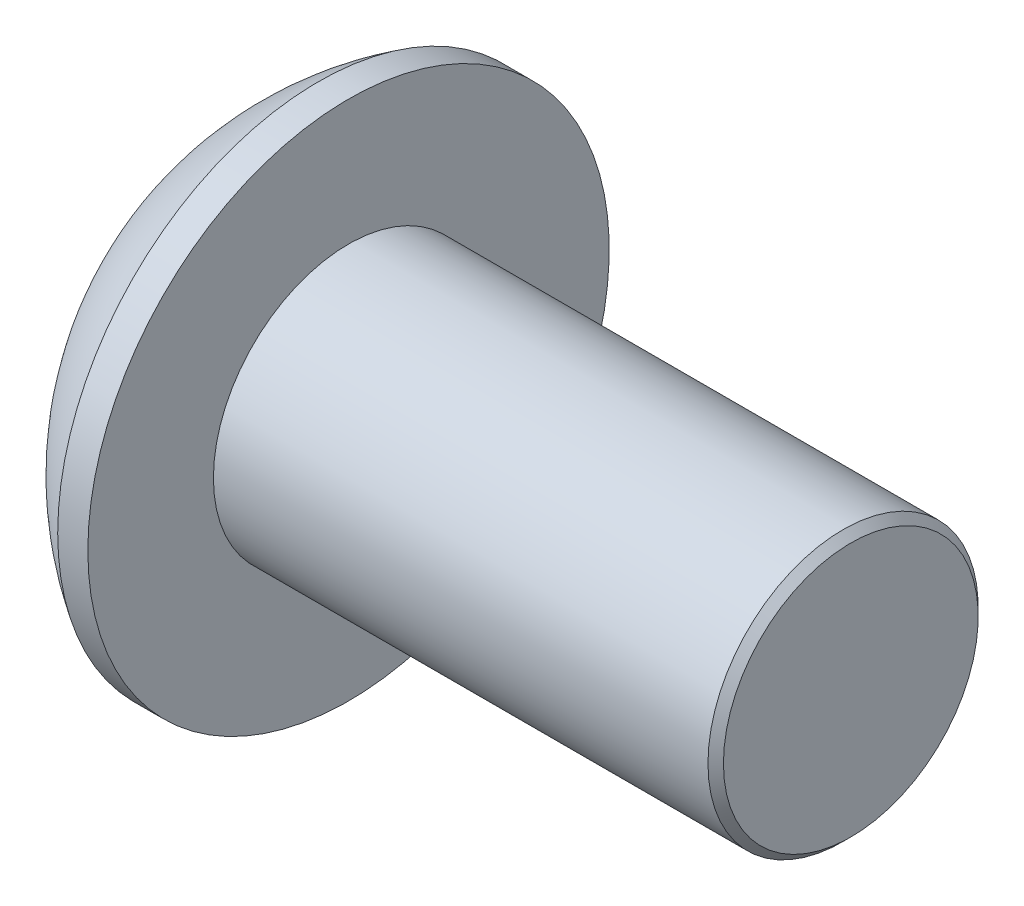
ISO-10303-21;
HEADER;
FILE_DESCRIPTION(('STEP AP214'),'2;1');
FILE_NAME('part.step','',(''),(''),'','','');
FILE_SCHEMA(('AUTOMOTIVE_DESIGN { 1 0 10303 214 1 1 1 1 }'));
ENDSEC;
DATA;
#1=APPLICATION_CONTEXT('core data for automotive mechanical design processes');
#2=APPLICATION_PROTOCOL_DEFINITION('international standard','automotive_design',2000,#1);
#3=PRODUCT_CONTEXT('',#1,'mechanical');
#4=PRODUCT('Part','Part','',(#3));
#5=PRODUCT_RELATED_PRODUCT_CATEGORY('part','',(#4));
#6=PRODUCT_DEFINITION_FORMATION('','',#4);
#7=PRODUCT_DEFINITION_CONTEXT('part definition',#1,'design');
#8=PRODUCT_DEFINITION('design','',#6,#7);
#9=PRODUCT_DEFINITION_SHAPE('','',#8);
#10=(LENGTH_UNIT() NAMED_UNIT(*) SI_UNIT(.MILLI.,.METRE.));
#11=(NAMED_UNIT(*) PLANE_ANGLE_UNIT() SI_UNIT($,.RADIAN.));
#12=(NAMED_UNIT(*) SI_UNIT($,.STERADIAN.) SOLID_ANGLE_UNIT());
#13=UNCERTAINTY_MEASURE_WITH_UNIT(LENGTH_MEASURE(1.E-05),#10,'distance_accuracy_value','');
#14=(GEOMETRIC_REPRESENTATION_CONTEXT(3) GLOBAL_UNCERTAINTY_ASSIGNED_CONTEXT((#13)) GLOBAL_UNIT_ASSIGNED_CONTEXT((#10,
#11,#12)) REPRESENTATION_CONTEXT('',''));
#15=CARTESIAN_POINT('',(0.,0.,0.));
#16=DIRECTION('',(0.,0.,1.));
#17=DIRECTION('',(1.,0.,0.));
#18=AXIS2_PLACEMENT_3D('',#15,#16,#17);
#19=CARTESIAN_POINT('',(8.20419999999999,0.,0.));
#20=DIRECTION('',(-1.,0.,0.));
#21=DIRECTION('',(0.,0.,1.));
#22=AXIS2_PLACEMENT_3D('',#19,#20,#21);
#23=PLANE('',#22);
#24=CARTESIAN_POINT('',(8.20419999996602,0.,0.));
#25=DIRECTION('',(-1.,0.,0.));
#26=DIRECTION('',(0.,0.,1.));
#27=AXIS2_PLACEMENT_3D('',#24,#25,#26);
#28=CIRCLE('',#27,1.61036000014295);
#29=CARTESIAN_POINT('',(8.20419999996602,0.,1.61036000014292));
#30=VERTEX_POINT('',#29);
#31=EDGE_CURVE('E21',#30,#30,#28,.T.);
#32=ORIENTED_EDGE('',*,*,#31,.F.);
#33=EDGE_LOOP('',(#32));
#34=FACE_BOUND('',#33,.T.);
#35=ADVANCED_FACE('F17',(#34),#23,.F.);
#36=CARTESIAN_POINT('',(8.10641000009582,0.,0.));
#37=DIRECTION('',(-1.,0.,0.));
#38=DIRECTION('',(0.,0.,1.));
#39=AXIS2_PLACEMENT_3D('',#36,#37,#38);
#40=CONICAL_SURFACE('',#39,1.7081499999563,0.785398163106808);
#41=ORIENTED_EDGE('',*,*,#31,.T.);
#42=EDGE_LOOP('',(#41));
#43=FACE_BOUND('',#42,.T.);
#44=CARTESIAN_POINT('',(8.10641000000001,0.,0.));
#45=DIRECTION('',(-1.,0.,0.));
#46=DIRECTION('',(0.,0.,1.));
#47=AXIS2_PLACEMENT_3D('',#44,#45,#46);
#48=CIRCLE('',#47,1.70815);
#49=CARTESIAN_POINT('',(8.10641000000001,0.,1.70815));
#50=VERTEX_POINT('',#49);
#51=EDGE_CURVE('E109',#50,#50,#48,.T.);
#52=ORIENTED_EDGE('',*,*,#51,.F.);
#53=EDGE_LOOP('',(#52));
#54=FACE_BOUND('',#53,.T.);
#55=ADVANCED_FACE('F311',(#43,#54),#40,.T.);
#56=CARTESIAN_POINT('',(1.32079999997359,0.,0.));
#57=DIRECTION('',(-1.,0.,0.));
#58=DIRECTION('',(0.,0.,1.));
#59=AXIS2_PLACEMENT_3D('',#56,#57,#58);
#60=CONICAL_SURFACE('',#59,1.19380000001001,1.04719755119008);
#61=CARTESIAN_POINT('',(2.0100407513155,0.,0.));
#62=VERTEX_POINT('',#61);
#63=VERTEX_LOOP('',#62);
#64=FACE_BOUND('',#63,.T.);
#65=CARTESIAN_POINT('',(1.32079999997359,0.,0.));
#66=DIRECTION('',(-1.,0.,0.));
#67=DIRECTION('',(0.,0.,1.));
#68=AXIS2_PLACEMENT_3D('',#65,#66,#67);
#69=CIRCLE('',#68,1.19380000001001);
#70=CARTESIAN_POINT('',(1.32079999998681,-1.0338611270422,0.596900000002504));
#71=VERTEX_POINT('',#70);
#72=CARTESIAN_POINT('',(1.32079999998681,0.,1.19380000000501));
#73=VERTEX_POINT('',#72);
#74=EDGE_CURVE('E94',#71,#73,#69,.T.);
#75=ORIENTED_EDGE('',*,*,#74,.T.);
#76=CARTESIAN_POINT('',(1.32079999997359,0.,0.));
#77=DIRECTION('',(-1.,0.,0.));
#78=DIRECTION('',(0.,0.,1.));
#79=AXIS2_PLACEMENT_3D('',#76,#77,#78);
#80=CIRCLE('',#79,1.19380000001001);
#81=CARTESIAN_POINT('',(1.32079999998681,1.0338611270422,0.596900000002503));
#82=VERTEX_POINT('',#81);
#83=EDGE_CURVE('E88',#73,#82,#80,.T.);
#84=ORIENTED_EDGE('',*,*,#83,.T.);
#85=CARTESIAN_POINT('',(1.32079999997359,0.,0.));
#86=DIRECTION('',(-1.,0.,0.));
#87=DIRECTION('',(0.,0.,1.));
#88=AXIS2_PLACEMENT_3D('',#85,#86,#87);
#89=CIRCLE('',#88,1.19380000001001);
#90=CARTESIAN_POINT('',(1.32079999998681,1.0338611270422,-0.596900000002504));
#91=VERTEX_POINT('',#90);
#92=EDGE_CURVE('E91',#82,#91,#89,.T.);
#93=ORIENTED_EDGE('',*,*,#92,.T.);
#94=CARTESIAN_POINT('',(1.32079999997359,0.,0.));
#95=DIRECTION('',(-1.,0.,0.));
#96=DIRECTION('',(0.,0.,1.));
#97=AXIS2_PLACEMENT_3D('',#94,#95,#96);
#98=CIRCLE('',#97,1.19380000001001);
#99=CARTESIAN_POINT('',(1.32079999998681,1.49525563250748E-12,-1.19380000000501));
#100=VERTEX_POINT('',#99);
#101=EDGE_CURVE('E153',#91,#100,#98,.T.);
#102=ORIENTED_EDGE('',*,*,#101,.T.);
#103=CARTESIAN_POINT('',(1.32079999997359,0.,0.));
#104=DIRECTION('',(-1.,0.,0.));
#105=DIRECTION('',(0.,0.,1.));
#106=AXIS2_PLACEMENT_3D('',#103,#104,#105);
#107=CIRCLE('',#106,1.19380000001001);
#108=CARTESIAN_POINT('',(1.32079999998681,-1.0338611270422,-0.596900000002502));
#109=VERTEX_POINT('',#108);
#110=EDGE_CURVE('E155',#100,#109,#107,.T.);
#111=ORIENTED_EDGE('',*,*,#110,.T.);
#112=CARTESIAN_POINT('',(1.32079999997359,0.,0.));
#113=DIRECTION('',(-1.,0.,0.));
#114=DIRECTION('',(0.,0.,1.));
#115=AXIS2_PLACEMENT_3D('',#112,#113,#114);
#116=CIRCLE('',#115,1.19380000001001);
#117=EDGE_CURVE('E157',#109,#71,#116,.T.);
#118=ORIENTED_EDGE('',*,*,#117,.T.);
#119=EDGE_LOOP('',(#75,#84,#93,#102,#111,#118));
#120=FACE_BOUND('',#119,.T.);
#121=ADVANCED_FACE('F90',(#64,#120),#60,.F.);
#122=CARTESIAN_POINT('',(0.,0.,0.));
#123=DIRECTION('',(-1.,0.,0.));
#124=DIRECTION('',(0.,0.,1.));
#125=AXIS2_PLACEMENT_3D('',#122,#123,#124);
#126=CYLINDRICAL_SURFACE('',#125,1.70815);
#127=ORIENTED_EDGE('',*,*,#51,.T.);
#128=EDGE_LOOP('',(#127));
#129=FACE_BOUND('',#128,.T.);
#130=CARTESIAN_POINT('',(1.8542,0.,0.));
#131=DIRECTION('',(-1.,0.,0.));
#132=DIRECTION('',(0.,0.,1.));
#133=AXIS2_PLACEMENT_3D('',#130,#131,#132);
#134=CIRCLE('',#133,1.70815);
#135=CARTESIAN_POINT('',(1.8542,0.,1.70815));
#136=VERTEX_POINT('',#135);
#137=EDGE_CURVE('E150',#136,#136,#134,.F.);
#138=ORIENTED_EDGE('',*,*,#137,.T.);
#139=EDGE_LOOP('',(#138));
#140=FACE_BOUND('',#139,.T.);
#141=ADVANCED_FACE('F302',(#129,#140),#126,.T.);
#142=CARTESIAN_POINT('',(1.3208,-2.06772225407573,-1.1938));
#143=DIRECTION('',(1.,0.,0.));
#144=DIRECTION('',(0.,0.,-1.));
#145=AXIS2_PLACEMENT_3D('',#142,#143,#144);
#146=PLANE('',#145);
#147=DIRECTION('',(0.,-0.5,-0.866025403784439));
#148=VECTOR('',#147,1.);
#149=CARTESIAN_POINT('',(1.32080000000004,1.37848150271715,0.));
#150=LINE('',#149,#148);
#151=CARTESIAN_POINT('',(1.32080000000001,1.37848150271715,0.));
#152=VERTEX_POINT('',#151);
#153=EDGE_CURVE('E107',#91,#152,#150,.F.);
#154=ORIENTED_EDGE('',*,*,#153,.F.);
#155=ORIENTED_EDGE('',*,*,#92,.F.);
#156=DIRECTION('',(0.,0.5,-0.866025403784439));
#157=VECTOR('',#156,1.);
#158=CARTESIAN_POINT('',(1.3208,0.689240751358573,1.1938));
#159=LINE('',#158,#157);
#160=EDGE_CURVE('E105',#152,#82,#159,.F.);
#161=ORIENTED_EDGE('',*,*,#160,.F.);
#162=EDGE_LOOP('',(#154,#155,#161));
#163=FACE_BOUND('',#162,.T.);
#164=ADVANCED_FACE('F103',(#163),#146,.F.);
#165=CARTESIAN_POINT('',(1.3208,-2.06772225407573,-1.1938));
#166=DIRECTION('',(1.,0.,0.));
#167=DIRECTION('',(0.,0.,-1.));
#168=AXIS2_PLACEMENT_3D('',#165,#166,#167);
#169=PLANE('',#168);
#170=DIRECTION('',(0.,0.5,-0.866025403784439));
#171=VECTOR('',#170,1.);
#172=CARTESIAN_POINT('',(1.32080000000004,0.689240751358573,1.1938));
#173=LINE('',#172,#171);
#174=CARTESIAN_POINT('',(1.32080000000001,0.689240751358576,1.1938));
#175=VERTEX_POINT('',#174);
#176=EDGE_CURVE('E110',#82,#175,#173,.F.);
#177=ORIENTED_EDGE('',*,*,#176,.F.);
#178=ORIENTED_EDGE('',*,*,#83,.F.);
#179=DIRECTION('',(0.,1.,0.));
#180=VECTOR('',#179,1.);
#181=CARTESIAN_POINT('',(1.3208,-0.689240751358573,1.1938));
#182=LINE('',#181,#180);
#183=EDGE_CURVE('E113',#175,#73,#182,.F.);
#184=ORIENTED_EDGE('',*,*,#183,.F.);
#185=EDGE_LOOP('',(#177,#178,#184));
#186=FACE_BOUND('',#185,.T.);
#187=ADVANCED_FACE('F111',(#186),#169,.F.);
#188=CARTESIAN_POINT('',(1.3208,-2.06772225407573,-1.1938));
#189=DIRECTION('',(1.,0.,0.));
#190=DIRECTION('',(0.,0.,-1.));
#191=AXIS2_PLACEMENT_3D('',#188,#189,#190);
#192=PLANE('',#191);
#193=DIRECTION('',(0.,1.,0.));
#194=VECTOR('',#193,1.);
#195=CARTESIAN_POINT('',(1.32080000000004,-0.689240751358573,1.1938));
#196=LINE('',#195,#194);
#197=CARTESIAN_POINT('',(1.32080000000001,-0.689240751358577,1.1938));
#198=VERTEX_POINT('',#197);
#199=EDGE_CURVE('E171',#73,#198,#196,.F.);
#200=ORIENTED_EDGE('',*,*,#199,.F.);
#201=ORIENTED_EDGE('',*,*,#74,.F.);
#202=DIRECTION('',(0.,0.5,0.866025403784439));
#203=VECTOR('',#202,1.);
#204=CARTESIAN_POINT('',(1.3208,-1.37848150271715,0.));
#205=LINE('',#204,#203);
#206=EDGE_CURVE('E169',#198,#71,#205,.F.);
#207=ORIENTED_EDGE('',*,*,#206,.F.);
#208=EDGE_LOOP('',(#200,#201,#207));
#209=FACE_BOUND('',#208,.T.);
#210=ADVANCED_FACE('F167',(#209),#192,.F.);
#211=CARTESIAN_POINT('',(1.3208,-2.06772225407573,-1.1938));
#212=DIRECTION('',(1.,0.,0.));
#213=DIRECTION('',(0.,0.,-1.));
#214=AXIS2_PLACEMENT_3D('',#211,#212,#213);
#215=PLANE('',#214);
#216=DIRECTION('',(0.,0.5,0.866025403784439));
#217=VECTOR('',#216,1.);
#218=CARTESIAN_POINT('',(1.32080000000004,-1.37848150271715,0.));
#219=LINE('',#218,#217);
#220=CARTESIAN_POINT('',(1.32080000000001,-1.37848150271715,0.));
#221=VERTEX_POINT('',#220);
#222=EDGE_CURVE('E172',#71,#221,#219,.F.);
#223=ORIENTED_EDGE('',*,*,#222,.F.);
#224=ORIENTED_EDGE('',*,*,#117,.F.);
#225=DIRECTION('',(0.,-0.5,0.866025403784439));
#226=VECTOR('',#225,1.);
#227=CARTESIAN_POINT('',(1.3208,-0.689240751358573,-1.1938));
#228=LINE('',#227,#226);
#229=EDGE_CURVE('E175',#221,#109,#228,.F.);
#230=ORIENTED_EDGE('',*,*,#229,.F.);
#231=EDGE_LOOP('',(#223,#224,#230));
#232=FACE_BOUND('',#231,.T.);
#233=ADVANCED_FACE('F173',(#232),#215,.F.);
#234=CARTESIAN_POINT('',(1.3208,-2.06772225407573,-1.1938));
#235=DIRECTION('',(1.,0.,0.));
#236=DIRECTION('',(0.,0.,-1.));
#237=AXIS2_PLACEMENT_3D('',#234,#235,#236);
#238=PLANE('',#237);
#239=DIRECTION('',(0.,-0.5,0.866025403784439));
#240=VECTOR('',#239,1.);
#241=CARTESIAN_POINT('',(1.32080000000004,-0.689240751358573,-1.1938));
#242=LINE('',#241,#240);
#243=CARTESIAN_POINT('',(1.32080000000001,-0.689240751358573,-1.1938));
#244=VERTEX_POINT('',#243);
#245=EDGE_CURVE('E230',#109,#244,#242,.F.);
#246=ORIENTED_EDGE('',*,*,#245,.F.);
#247=ORIENTED_EDGE('',*,*,#110,.F.);
#248=DIRECTION('',(0.,-1.,0.));
#249=VECTOR('',#248,1.);
#250=CARTESIAN_POINT('',(1.3208,0.689240751358573,-1.1938));
#251=LINE('',#250,#249);
#252=EDGE_CURVE('E242',#244,#100,#251,.F.);
#253=ORIENTED_EDGE('',*,*,#252,.F.);
#254=EDGE_LOOP('',(#246,#247,#253));
#255=FACE_BOUND('',#254,.T.);
#256=ADVANCED_FACE('F263',(#255),#238,.F.);
#257=CARTESIAN_POINT('',(1.3208,-2.06772225407573,-1.1938));
#258=DIRECTION('',(1.,0.,0.));
#259=DIRECTION('',(0.,0.,-1.));
#260=AXIS2_PLACEMENT_3D('',#257,#258,#259);
#261=PLANE('',#260);
#262=DIRECTION('',(0.,-1.,0.));
#263=VECTOR('',#262,1.);
#264=CARTESIAN_POINT('',(1.32080000000004,0.689240751358573,-1.1938));
#265=LINE('',#264,#263);
#266=CARTESIAN_POINT('',(1.32080000000002,0.689240751358564,-1.19380000000002));
#267=VERTEX_POINT('',#266);
#268=EDGE_CURVE('E250',#100,#267,#265,.F.);
#269=ORIENTED_EDGE('',*,*,#268,.F.);
#270=ORIENTED_EDGE('',*,*,#101,.F.);
#271=DIRECTION('',(0.,-0.5,-0.866025403784439));
#272=VECTOR('',#271,1.);
#273=CARTESIAN_POINT('',(1.3208,1.37848150271715,0.));
#274=LINE('',#273,#272);
#275=EDGE_CURVE('E132',#267,#91,#274,.F.);
#276=ORIENTED_EDGE('',*,*,#275,.F.);
#277=EDGE_LOOP('',(#269,#270,#276));
#278=FACE_BOUND('',#277,.T.);
#279=ADVANCED_FACE('F265',(#278),#261,.F.);
#280=CARTESIAN_POINT('',(1.8542,1.70815,0.));
#281=DIRECTION('',(-1.,0.,0.));
#282=DIRECTION('',(0.,0.,1.));
#283=AXIS2_PLACEMENT_3D('',#280,#281,#282);
#284=PLANE('',#283);
#285=CARTESIAN_POINT('',(1.8542,0.,0.));
#286=DIRECTION('',(-1.,0.,0.));
#287=DIRECTION('',(0.,0.,1.));
#288=AXIS2_PLACEMENT_3D('',#285,#286,#287);
#289=CIRCLE('',#288,3.29565);
#290=CARTESIAN_POINT('',(1.8542,0.,3.29565));
#291=VERTEX_POINT('',#290);
#292=EDGE_CURVE('E139',#291,#291,#289,.T.);
#293=ORIENTED_EDGE('',*,*,#292,.F.);
#294=EDGE_LOOP('',(#293));
#295=FACE_BOUND('',#294,.T.);
#296=ORIENTED_EDGE('',*,*,#137,.F.);
#297=EDGE_LOOP('',(#296));
#298=FACE_BOUND('',#297,.T.);
#299=ADVANCED_FACE('F296',(#295,#298),#284,.F.);
#300=CARTESIAN_POINT('',(1.3208,1.37848150271715,0.));
#301=DIRECTION('',(0.,-0.866025403784439,0.5));
#302=DIRECTION('',(0.,-0.5,-0.866025403784439));
#303=AXIS2_PLACEMENT_3D('',#300,#301,#302);
#304=PLANE('',#303);
#305=ORIENTED_EDGE('',*,*,#153,.T.);
#306=DIRECTION('',(1.,0.,0.));
#307=VECTOR('',#306,1.);
#308=CARTESIAN_POINT('',(1.3208,1.37848150271715,0.));
#309=LINE('',#308,#307);
#310=CARTESIAN_POINT('',(0.,1.37848150271715,0.));
#311=VERTEX_POINT('',#310);
#312=EDGE_CURVE('E120',#311,#152,#309,.T.);
#313=ORIENTED_EDGE('',*,*,#312,.F.);
#314=DIRECTION('',(0.,0.500000000000001,0.866025403784438));
#315=VECTOR('',#314,1.);
#316=CARTESIAN_POINT('',(0.,0.689240751358577,-1.1938));
#317=LINE('',#316,#315);
#318=CARTESIAN_POINT('',(0.,0.689240751358577,-1.1938));
#319=VERTEX_POINT('',#318);
#320=EDGE_CURVE('E135',#319,#311,#317,.T.);
#321=ORIENTED_EDGE('',*,*,#320,.F.);
#322=DIRECTION('',(1.,0.,0.));
#323=VECTOR('',#322,1.);
#324=CARTESIAN_POINT('',(1.3208,0.689240751358573,-1.1938));
#325=LINE('',#324,#323);
#326=EDGE_CURVE('E149',#267,#319,#325,.F.);
#327=ORIENTED_EDGE('',*,*,#326,.F.);
#328=ORIENTED_EDGE('',*,*,#275,.T.);
#329=EDGE_LOOP('',(#305,#313,#321,#327,#328));
#330=FACE_BOUND('',#329,.T.);
#331=ADVANCED_FACE('F268',(#330),#304,.T.);
#332=CARTESIAN_POINT('',(1.3208,0.689240751358573,1.1938));
#333=DIRECTION('',(0.,-0.866025403784439,-0.5));
#334=DIRECTION('',(0.,0.5,-0.866025403784439));
#335=AXIS2_PLACEMENT_3D('',#332,#333,#334);
#336=PLANE('',#335);
#337=ORIENTED_EDGE('',*,*,#176,.T.);
#338=DIRECTION('',(1.,0.,0.));
#339=VECTOR('',#338,1.);
#340=CARTESIAN_POINT('',(1.3208,0.689240751358577,1.1938));
#341=LINE('',#340,#339);
#342=CARTESIAN_POINT('',(0.,0.689240751358576,1.1938));
#343=VERTEX_POINT('',#342);
#344=EDGE_CURVE('E116',#343,#175,#341,.T.);
#345=ORIENTED_EDGE('',*,*,#344,.F.);
#346=DIRECTION('',(0.,-0.500000000000001,0.866025403784438));
#347=VECTOR('',#346,1.);
#348=CARTESIAN_POINT('',(0.,1.37848150271715,0.));
#349=LINE('',#348,#347);
#350=EDGE_CURVE('E138',#311,#343,#349,.T.);
#351=ORIENTED_EDGE('',*,*,#350,.F.);
#352=ORIENTED_EDGE('',*,*,#312,.T.);
#353=ORIENTED_EDGE('',*,*,#160,.T.);
#354=EDGE_LOOP('',(#337,#345,#351,#352,#353));
#355=FACE_BOUND('',#354,.T.);
#356=ADVANCED_FACE('F118',(#355),#336,.T.);
#357=CARTESIAN_POINT('',(1.3208,-0.689240751358573,1.1938));
#358=DIRECTION('',(0.,0.,-1.));
#359=DIRECTION('',(0.,1.,0.));
#360=AXIS2_PLACEMENT_3D('',#357,#358,#359);
#361=PLANE('',#360);
#362=ORIENTED_EDGE('',*,*,#199,.T.);
#363=DIRECTION('',(1.,0.,0.));
#364=VECTOR('',#363,1.);
#365=CARTESIAN_POINT('',(1.3208,-0.689240751358578,1.1938));
#366=LINE('',#365,#364);
#367=CARTESIAN_POINT('',(0.,-0.689240751358576,1.1938));
#368=VERTEX_POINT('',#367);
#369=EDGE_CURVE('E182',#368,#198,#366,.T.);
#370=ORIENTED_EDGE('',*,*,#369,.F.);
#371=DIRECTION('',(0.,1.,0.));
#372=VECTOR('',#371,1.);
#373=CARTESIAN_POINT('',(0.,0.,1.1938));
#374=LINE('',#373,#372);
#375=EDGE_CURVE('E196',#343,#368,#374,.F.);
#376=ORIENTED_EDGE('',*,*,#375,.F.);
#377=ORIENTED_EDGE('',*,*,#344,.T.);
#378=ORIENTED_EDGE('',*,*,#183,.T.);
#379=EDGE_LOOP('',(#362,#370,#376,#377,#378));
#380=FACE_BOUND('',#379,.T.);
#381=ADVANCED_FACE('F218',(#380),#361,.T.);
#382=CARTESIAN_POINT('',(1.3208,-1.37848150271715,0.));
#383=DIRECTION('',(0.,0.866025403784439,-0.5));
#384=DIRECTION('',(0.,0.5,0.866025403784439));
#385=AXIS2_PLACEMENT_3D('',#382,#383,#384);
#386=PLANE('',#385);
#387=ORIENTED_EDGE('',*,*,#222,.T.);
#388=DIRECTION('',(1.,0.,0.));
#389=VECTOR('',#388,1.);
#390=CARTESIAN_POINT('',(1.3208,-1.37848150271715,0.));
#391=LINE('',#390,#389);
#392=CARTESIAN_POINT('',(0.,-1.37848150271715,0.));
#393=VERTEX_POINT('',#392);
#394=EDGE_CURVE('E178',#393,#221,#391,.T.);
#395=ORIENTED_EDGE('',*,*,#394,.F.);
#396=DIRECTION('',(0.,-0.500000000000003,-0.866025403784437));
#397=VECTOR('',#396,1.);
#398=CARTESIAN_POINT('',(0.,-0.689240751358573,1.1938));
#399=LINE('',#398,#397);
#400=EDGE_CURVE('E199',#368,#393,#399,.T.);
#401=ORIENTED_EDGE('',*,*,#400,.F.);
#402=ORIENTED_EDGE('',*,*,#369,.T.);
#403=ORIENTED_EDGE('',*,*,#206,.T.);
#404=EDGE_LOOP('',(#387,#395,#401,#402,#403));
#405=FACE_BOUND('',#404,.T.);
#406=ADVANCED_FACE('F180',(#405),#386,.T.);
#407=CARTESIAN_POINT('',(1.3208,-0.689240751358573,-1.1938));
#408=DIRECTION('',(0.,0.866025403784439,0.5));
#409=DIRECTION('',(0.,-0.5,0.866025403784439));
#410=AXIS2_PLACEMENT_3D('',#407,#408,#409);
#411=PLANE('',#410);
#412=ORIENTED_EDGE('',*,*,#245,.T.);
#413=DIRECTION('',(1.,0.,0.));
#414=VECTOR('',#413,1.);
#415=CARTESIAN_POINT('',(1.3208,-0.689240751358573,-1.1938));
#416=LINE('',#415,#414);
#417=CARTESIAN_POINT('',(0.,-0.689240751358573,-1.1938));
#418=VERTEX_POINT('',#417);
#419=EDGE_CURVE('E36',#418,#244,#416,.T.);
#420=ORIENTED_EDGE('',*,*,#419,.F.);
#421=DIRECTION('',(0.,0.500000000000003,-0.866025403784437));
#422=VECTOR('',#421,1.);
#423=CARTESIAN_POINT('',(0.,-1.37848150271715,0.));
#424=LINE('',#423,#422);
#425=EDGE_CURVE('E219',#393,#418,#424,.T.);
#426=ORIENTED_EDGE('',*,*,#425,.F.);
#427=ORIENTED_EDGE('',*,*,#394,.T.);
#428=ORIENTED_EDGE('',*,*,#229,.T.);
#429=EDGE_LOOP('',(#412,#420,#426,#427,#428));
#430=FACE_BOUND('',#429,.T.);
#431=ADVANCED_FACE('F269',(#430),#411,.T.);
#432=CARTESIAN_POINT('',(1.3208,0.689240751358573,-1.1938));
#433=DIRECTION('',(0.,0.,1.));
#434=DIRECTION('',(0.,-1.,0.));
#435=AXIS2_PLACEMENT_3D('',#432,#433,#434);
#436=PLANE('',#435);
#437=ORIENTED_EDGE('',*,*,#268,.T.);
#438=ORIENTED_EDGE('',*,*,#326,.T.);
#439=DIRECTION('',(0.,1.,0.));
#440=VECTOR('',#439,1.);
#441=CARTESIAN_POINT('',(0.,0.,-1.1938));
#442=LINE('',#441,#440);
#443=EDGE_CURVE('E146',#418,#319,#442,.T.);
#444=ORIENTED_EDGE('',*,*,#443,.F.);
#445=ORIENTED_EDGE('',*,*,#419,.T.);
#446=ORIENTED_EDGE('',*,*,#252,.T.);
#447=EDGE_LOOP('',(#437,#438,#444,#445,#446));
#448=FACE_BOUND('',#447,.T.);
#449=ADVANCED_FACE('F260',(#448),#436,.T.);
#450=CARTESIAN_POINT('',(0.,0.,0.));
#451=DIRECTION('',(-1.,0.,0.));
#452=DIRECTION('',(0.,0.,1.));
#453=AXIS2_PLACEMENT_3D('',#450,#451,#452);
#454=CYLINDRICAL_SURFACE('',#453,3.29565);
#455=CARTESIAN_POINT('',(1.47320000000001,0.,0.));
#456=DIRECTION('',(-1.,0.,0.));
#457=DIRECTION('',(0.,0.,1.));
#458=AXIS2_PLACEMENT_3D('',#455,#456,#457);
#459=CIRCLE('',#458,3.29565);
#460=CARTESIAN_POINT('',(1.47320000000001,0.,3.29565));
#461=VERTEX_POINT('',#460);
#462=EDGE_CURVE('E27',#461,#461,#459,.T.);
#463=ORIENTED_EDGE('',*,*,#462,.F.);
#464=EDGE_LOOP('',(#463));
#465=FACE_BOUND('',#464,.T.);
#466=ORIENTED_EDGE('',*,*,#292,.T.);
#467=EDGE_LOOP('',(#466));
#468=FACE_BOUND('',#467,.T.);
#469=ADVANCED_FACE('F277',(#465,#468),#454,.T.);
#470=CARTESIAN_POINT('',(0.,0.,0.));
#471=DIRECTION('',(-1.,0.,0.));
#472=DIRECTION('',(0.,0.,1.));
#473=AXIS2_PLACEMENT_3D('',#470,#471,#472);
#474=PLANE('',#473);
#475=CARTESIAN_POINT('',(0.,0.,0.));
#476=DIRECTION('',(-1.,0.,0.));
#477=DIRECTION('',(0.,0.,1.));
#478=AXIS2_PLACEMENT_3D('',#475,#476,#477);
#479=CIRCLE('',#478,1.64782500000001);
#480=CARTESIAN_POINT('',(0.,0.,1.64782500000001));
#481=VERTEX_POINT('',#480);
#482=EDGE_CURVE('E11',#481,#481,#479,.F.);
#483=ORIENTED_EDGE('',*,*,#482,.F.);
#484=EDGE_LOOP('',(#483));
#485=FACE_BOUND('',#484,.T.);
#486=ORIENTED_EDGE('',*,*,#425,.T.);
#487=ORIENTED_EDGE('',*,*,#443,.T.);
#488=ORIENTED_EDGE('',*,*,#320,.T.);
#489=ORIENTED_EDGE('',*,*,#350,.T.);
#490=ORIENTED_EDGE('',*,*,#375,.T.);
#491=ORIENTED_EDGE('',*,*,#400,.T.);
#492=EDGE_LOOP('',(#486,#487,#488,#489,#490,#491));
#493=FACE_BOUND('',#492,.T.);
#494=ADVANCED_FACE('F212',(#485,#493),#474,.T.);
#495=CARTESIAN_POINT('',(3.50132362607758,0.,0.));
#496=DIRECTION('',(0.,1.,0.));
#497=DIRECTION('',(-0.511318777660708,0.,-0.859391126095423));
#498=AXIS2_PLACEMENT_3D('',#495,#496,#497);
#499=SPHERICAL_SURFACE('',#498,3.86970210289553);
#500=CARTESIAN_POINT('',(3.50132362607758,0.,0.));
#501=DIRECTION('',(-1.,0.,0.));
#502=DIRECTION('',(0.,0.,1.));
#503=AXIS2_PLACEMENT_3D('',#500,#501,#502);
#504=SPHERICAL_SURFACE('',#503,3.86970210289553);
#505=ORIENTED_EDGE('',*,*,#482,.T.);
#506=EDGE_LOOP('',(#505));
#507=FACE_BOUND('',#506,.T.);
#508=ORIENTED_EDGE('',*,*,#462,.T.);
#509=EDGE_LOOP('',(#508));
#510=FACE_BOUND('',#509,.T.);
#511=ADVANCED_FACE('F19',(#507,#510),#504,.T.);
#512=CLOSED_SHELL('',(#35,#55,#121,#141,#164,#187,#210,#233,#256,#279,#299,#331,#356,#381,#406,
#431,#449,#469,#494,#511));
#513=MANIFOLD_SOLID_BREP('B1',#512);
#514=ADVANCED_BREP_SHAPE_REPRESENTATION('',(#18,#513),#14);
#515=SHAPE_DEFINITION_REPRESENTATION(#9,#514);
ENDSEC;
END-ISO-10303-21;
